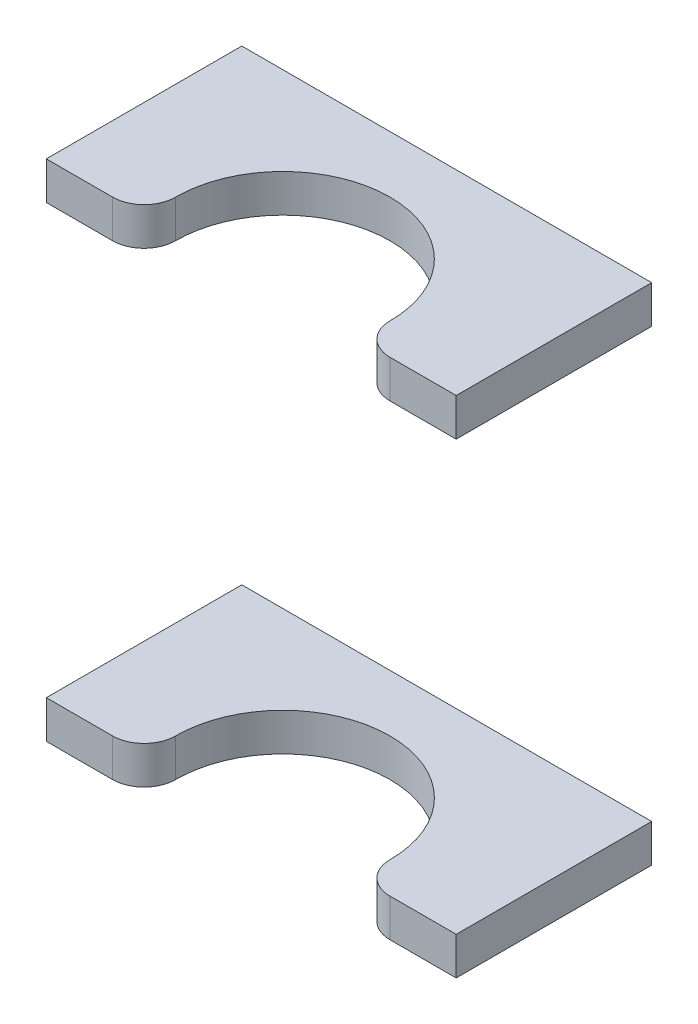
ISO-10303-21;
HEADER;
FILE_DESCRIPTION(('STEP AP214'),'2;1');
FILE_NAME('part.step','',(''),(''),'','','');
FILE_SCHEMA(('AUTOMOTIVE_DESIGN { 1 0 10303 214 1 1 1 1 }'));
ENDSEC;
DATA;
#1=APPLICATION_CONTEXT('core data for automotive mechanical design processes');
#2=APPLICATION_PROTOCOL_DEFINITION('international standard','automotive_design',2000,#1);
#3=PRODUCT_CONTEXT('',#1,'mechanical');
#4=PRODUCT('Part','Part','',(#3));
#5=PRODUCT_RELATED_PRODUCT_CATEGORY('part','',(#4));
#6=PRODUCT_DEFINITION_FORMATION('','',#4);
#7=PRODUCT_DEFINITION_CONTEXT('part definition',#1,'design');
#8=PRODUCT_DEFINITION('design','',#6,#7);
#9=PRODUCT_DEFINITION_SHAPE('','',#8);
#10=(LENGTH_UNIT() NAMED_UNIT(*) SI_UNIT(.MILLI.,.METRE.));
#11=(NAMED_UNIT(*) PLANE_ANGLE_UNIT() SI_UNIT($,.RADIAN.));
#12=(NAMED_UNIT(*) SI_UNIT($,.STERADIAN.) SOLID_ANGLE_UNIT());
#13=UNCERTAINTY_MEASURE_WITH_UNIT(LENGTH_MEASURE(1.E-05),#10,'distance_accuracy_value','');
#14=(GEOMETRIC_REPRESENTATION_CONTEXT(3) GLOBAL_UNCERTAINTY_ASSIGNED_CONTEXT((#13)) GLOBAL_UNIT_ASSIGNED_CONTEXT((#10,
#11,#12)) REPRESENTATION_CONTEXT('',''));
#15=CARTESIAN_POINT('',(0.,0.,0.));
#16=DIRECTION('',(0.,0.,1.));
#17=DIRECTION('',(1.,0.,0.));
#18=AXIS2_PLACEMENT_3D('',#15,#16,#17);
#19=CARTESIAN_POINT('',(-315.,100.,111.27633568147));
#20=DIRECTION('',(0.,-1.,0.));
#21=DIRECTION('',(0.,0.,-1.));
#22=AXIS2_PLACEMENT_3D('',#19,#20,#21);
#23=PLANE('',#22);
#24=DIRECTION('',(-1.,0.,0.));
#25=VECTOR('',#24,1.);
#26=CARTESIAN_POINT('',(-369.5,100.,30.9999999999995));
#27=LINE('',#26,#25);
#28=CARTESIAN_POINT('',(-380.,100.,30.9999999999993));
#29=VERTEX_POINT('',#28);
#30=CARTESIAN_POINT('',(-369.5,100.,30.9999999999994));
#31=VERTEX_POINT('',#30);
#32=EDGE_CURVE('P0_E127',#29,#31,#27,.F.);
#33=ORIENTED_EDGE('',*,*,#32,.T.);
#34=CARTESIAN_POINT('',(-369.5,100.,25.9999999999994));
#35=DIRECTION('',(0.,-1.,0.));
#36=DIRECTION('',(1.,0.,0.));
#37=AXIS2_PLACEMENT_3D('',#34,#35,#36);
#38=CIRCLE('',#37,5.);
#39=CARTESIAN_POINT('',(-364.5,100.,25.9999999999994));
#40=VERTEX_POINT('',#39);
#41=EDGE_CURVE('P0_E124',#40,#31,#38,.T.);
#42=ORIENTED_EDGE('',*,*,#41,.F.);
#43=CARTESIAN_POINT('',(-347.5,100.,25.9999999999994));
#44=DIRECTION('',(0.,-1.,0.));
#45=DIRECTION('',(1.,0.,0.));
#46=AXIS2_PLACEMENT_3D('',#43,#44,#45);
#47=CIRCLE('',#46,17.);
#48=CARTESIAN_POINT('',(-330.5,100.,25.9999999999994));
#49=VERTEX_POINT('',#48);
#50=EDGE_CURVE('P0_E19',#40,#49,#47,.T.);
#51=ORIENTED_EDGE('',*,*,#50,.T.);
#52=CARTESIAN_POINT('',(-325.5,100.,25.9999999999994));
#53=DIRECTION('',(0.,-1.,0.));
#54=DIRECTION('',(1.,0.,0.));
#55=AXIS2_PLACEMENT_3D('',#52,#53,#54);
#56=CIRCLE('',#55,5.);
#57=CARTESIAN_POINT('',(-325.5,100.,30.9999999999995));
#58=VERTEX_POINT('',#57);
#59=EDGE_CURVE('P0_E158',#58,#49,#56,.T.);
#60=ORIENTED_EDGE('',*,*,#59,.F.);
#61=DIRECTION('',(-1.,0.,0.));
#62=VECTOR('',#61,1.);
#63=CARTESIAN_POINT('',(-325.5,100.,30.9999999999995));
#64=LINE('',#63,#62);
#65=CARTESIAN_POINT('',(-315.,100.,30.9999999999993));
#66=VERTEX_POINT('',#65);
#67=EDGE_CURVE('P0_E96',#58,#66,#64,.F.);
#68=ORIENTED_EDGE('',*,*,#67,.T.);
#69=DIRECTION('',(0.,0.,1.));
#70=VECTOR('',#69,1.);
#71=CARTESIAN_POINT('',(-315.,100.,111.27633568147));
#72=LINE('',#71,#70);
#73=CARTESIAN_POINT('',(-315.,100.,0.));
#74=VERTEX_POINT('',#73);
#75=EDGE_CURVE('P0_E92',#66,#74,#72,.F.);
#76=ORIENTED_EDGE('',*,*,#75,.T.);
#77=DIRECTION('',(-1.,0.,0.));
#78=VECTOR('',#77,1.);
#79=CARTESIAN_POINT('',(0.,100.,0.));
#80=LINE('',#79,#78);
#81=CARTESIAN_POINT('',(-380.,100.,0.));
#82=VERTEX_POINT('',#81);
#83=EDGE_CURVE('P0_E141',#82,#74,#80,.F.);
#84=ORIENTED_EDGE('',*,*,#83,.F.);
#85=DIRECTION('',(0.,0.,1.));
#86=VECTOR('',#85,1.);
#87=CARTESIAN_POINT('',(-380.,100.,111.27633568147));
#88=LINE('',#87,#86);
#89=EDGE_CURVE('P0_E71',#82,#29,#88,.T.);
#90=ORIENTED_EDGE('',*,*,#89,.T.);
#91=EDGE_LOOP('',(#33,#42,#51,#60,#68,#76,#84,#90));
#92=FACE_BOUND('',#91,.T.);
#93=ADVANCED_FACE('P0_F16',(#92),#23,.F.);
#94=CARTESIAN_POINT('',(-347.5,100.,25.9999999999994));
#95=DIRECTION('',(0.,-1.,0.));
#96=DIRECTION('',(1.,0.,0.));
#97=AXIS2_PLACEMENT_3D('',#94,#95,#96);
#98=CYLINDRICAL_SURFACE('',#97,17.);
#99=ORIENTED_EDGE('',*,*,#50,.F.);
#100=DIRECTION('',(0.,-1.,0.));
#101=VECTOR('',#100,1.);
#102=CARTESIAN_POINT('',(-364.5,100.,25.9999999999994));
#103=LINE('',#102,#101);
#104=CARTESIAN_POINT('',(-364.5,94.,25.9999999999994));
#105=VERTEX_POINT('',#104);
#106=EDGE_CURVE('P0_E125',#105,#40,#103,.F.);
#107=ORIENTED_EDGE('',*,*,#106,.F.);
#108=CARTESIAN_POINT('',(-347.5,94.,25.9999999999994));
#109=DIRECTION('',(0.,-1.,0.));
#110=DIRECTION('',(1.,0.,0.));
#111=AXIS2_PLACEMENT_3D('',#108,#109,#110);
#112=CIRCLE('',#111,17.);
#113=CARTESIAN_POINT('',(-330.5,94.,25.9999999999994));
#114=VERTEX_POINT('',#113);
#115=EDGE_CURVE('P0_E115',#105,#114,#112,.T.);
#116=ORIENTED_EDGE('',*,*,#115,.T.);
#117=DIRECTION('',(0.,-1.,0.));
#118=VECTOR('',#117,1.);
#119=CARTESIAN_POINT('',(-330.5,100.,25.9999999999994));
#120=LINE('',#119,#118);
#121=EDGE_CURVE('P0_E156',#49,#114,#120,.T.);
#122=ORIENTED_EDGE('',*,*,#121,.F.);
#123=EDGE_LOOP('',(#99,#107,#116,#122));
#124=FACE_BOUND('',#123,.T.);
#125=ADVANCED_FACE('P0_F181',(#124),#98,.F.);
#126=CARTESIAN_POINT('',(-325.5,100.,25.9999999999994));
#127=DIRECTION('',(0.,-1.,0.));
#128=DIRECTION('',(1.,0.,0.));
#129=AXIS2_PLACEMENT_3D('',#126,#127,#128);
#130=CYLINDRICAL_SURFACE('',#129,5.);
#131=ORIENTED_EDGE('',*,*,#121,.T.);
#132=CARTESIAN_POINT('',(-325.5,94.,25.9999999999994));
#133=DIRECTION('',(0.,-1.,0.));
#134=DIRECTION('',(1.,0.,0.));
#135=AXIS2_PLACEMENT_3D('',#132,#133,#134);
#136=CIRCLE('',#135,5.);
#137=CARTESIAN_POINT('',(-325.5,94.,30.9999999999995));
#138=VERTEX_POINT('',#137);
#139=EDGE_CURVE('P0_E113',#114,#138,#136,.F.);
#140=ORIENTED_EDGE('',*,*,#139,.T.);
#141=DIRECTION('',(0.,1.,0.));
#142=VECTOR('',#141,1.);
#143=CARTESIAN_POINT('',(-325.5,100.,30.9999999999995));
#144=LINE('',#143,#142);
#145=EDGE_CURVE('P0_E112',#138,#58,#144,.T.);
#146=ORIENTED_EDGE('',*,*,#145,.T.);
#147=ORIENTED_EDGE('',*,*,#59,.T.);
#148=EDGE_LOOP('',(#131,#140,#146,#147));
#149=FACE_BOUND('',#148,.T.);
#150=ADVANCED_FACE('P0_F182',(#149),#130,.T.);
#151=CARTESIAN_POINT('',(-325.5,100.,30.9999999999995));
#152=DIRECTION('',(0.,0.,-1.));
#153=DIRECTION('',(-1.,0.,0.));
#154=AXIS2_PLACEMENT_3D('',#151,#152,#153);
#155=PLANE('',#154);
#156=ORIENTED_EDGE('',*,*,#67,.F.);
#157=ORIENTED_EDGE('',*,*,#145,.F.);
#158=DIRECTION('',(-1.,0.,0.));
#159=VECTOR('',#158,1.);
#160=CARTESIAN_POINT('',(-315.,94.,30.9999999999995));
#161=LINE('',#160,#159);
#162=CARTESIAN_POINT('',(-315.,94.,30.9999999999994));
#163=VERTEX_POINT('',#162);
#164=EDGE_CURVE('P0_E104',#138,#163,#161,.F.);
#165=ORIENTED_EDGE('',*,*,#164,.T.);
#166=DIRECTION('',(0.,1.,0.));
#167=VECTOR('',#166,1.);
#168=CARTESIAN_POINT('',(-315.,100.,30.9999999999993));
#169=LINE('',#168,#167);
#170=EDGE_CURVE('P0_E87',#163,#66,#169,.T.);
#171=ORIENTED_EDGE('',*,*,#170,.T.);
#172=EDGE_LOOP('',(#156,#157,#165,#171));
#173=FACE_BOUND('',#172,.T.);
#174=ADVANCED_FACE('P0_F110',(#173),#155,.F.);
#175=CARTESIAN_POINT('',(-315.,100.,111.27633568147));
#176=DIRECTION('',(-1.,0.,0.));
#177=DIRECTION('',(0.,0.,1.));
#178=AXIS2_PLACEMENT_3D('',#175,#176,#177);
#179=PLANE('',#178);
#180=ORIENTED_EDGE('',*,*,#170,.F.);
#181=DIRECTION('',(0.,0.,1.));
#182=VECTOR('',#181,1.);
#183=CARTESIAN_POINT('',(-315.,94.,111.27633568147));
#184=LINE('',#183,#182);
#185=CARTESIAN_POINT('',(-315.,94.,0.));
#186=VERTEX_POINT('',#185);
#187=EDGE_CURVE('P0_E91',#163,#186,#184,.F.);
#188=ORIENTED_EDGE('',*,*,#187,.T.);
#189=DIRECTION('',(0.,1.,0.));
#190=VECTOR('',#189,1.);
#191=CARTESIAN_POINT('',(-315.,0.,0.));
#192=LINE('',#191,#190);
#193=EDGE_CURVE('P0_E147',#74,#186,#192,.F.);
#194=ORIENTED_EDGE('',*,*,#193,.F.);
#195=ORIENTED_EDGE('',*,*,#75,.F.);
#196=EDGE_LOOP('',(#180,#188,#194,#195));
#197=FACE_BOUND('',#196,.T.);
#198=ADVANCED_FACE('P0_F89',(#197),#179,.F.);
#199=CARTESIAN_POINT('',(0.,0.,0.));
#200=DIRECTION('',(0.,0.,-1.));
#201=DIRECTION('',(-1.,0.,0.));
#202=AXIS2_PLACEMENT_3D('',#199,#200,#201);
#203=PLANE('',#202);
#204=DIRECTION('',(0.,1.,0.));
#205=VECTOR('',#204,1.);
#206=CARTESIAN_POINT('',(-380.,100.,0.));
#207=LINE('',#206,#205);
#208=CARTESIAN_POINT('',(-380.,94.,0.));
#209=VERTEX_POINT('',#208);
#210=EDGE_CURVE('P0_E138',#209,#82,#207,.T.);
#211=ORIENTED_EDGE('',*,*,#210,.T.);
#212=ORIENTED_EDGE('',*,*,#83,.T.);
#213=ORIENTED_EDGE('',*,*,#193,.T.);
#214=DIRECTION('',(-1.,0.,0.));
#215=VECTOR('',#214,1.);
#216=CARTESIAN_POINT('',(-315.,94.,0.));
#217=LINE('',#216,#215);
#218=EDGE_CURVE('P0_E108',#186,#209,#217,.T.);
#219=ORIENTED_EDGE('',*,*,#218,.T.);
#220=EDGE_LOOP('',(#211,#212,#213,#219));
#221=FACE_BOUND('',#220,.T.);
#222=ADVANCED_FACE('P0_F200',(#221),#203,.T.);
#223=CARTESIAN_POINT('',(-380.,100.,111.27633568147));
#224=DIRECTION('',(1.,0.,0.));
#225=DIRECTION('',(0.,1.,0.));
#226=AXIS2_PLACEMENT_3D('',#223,#224,#225);
#227=PLANE('',#226);
#228=DIRECTION('',(0.,1.,0.));
#229=VECTOR('',#228,1.);
#230=CARTESIAN_POINT('',(-380.,100.,30.9999999999994));
#231=LINE('',#230,#229);
#232=CARTESIAN_POINT('',(-380.,94.,30.9999999999993));
#233=VERTEX_POINT('',#232);
#234=EDGE_CURVE('P0_E128',#233,#29,#231,.T.);
#235=ORIENTED_EDGE('',*,*,#234,.T.);
#236=ORIENTED_EDGE('',*,*,#89,.F.);
#237=ORIENTED_EDGE('',*,*,#210,.F.);
#238=DIRECTION('',(0.,0.,1.));
#239=VECTOR('',#238,1.);
#240=CARTESIAN_POINT('',(-380.,94.,111.27633568147));
#241=LINE('',#240,#239);
#242=EDGE_CURVE('P0_E133',#209,#233,#241,.T.);
#243=ORIENTED_EDGE('',*,*,#242,.T.);
#244=EDGE_LOOP('',(#235,#236,#237,#243));
#245=FACE_BOUND('',#244,.T.);
#246=ADVANCED_FACE('P0_F194',(#245),#227,.F.);
#247=CARTESIAN_POINT('',(-369.5,100.,30.9999999999995));
#248=DIRECTION('',(0.,0.,-1.));
#249=DIRECTION('',(-1.,0.,0.));
#250=AXIS2_PLACEMENT_3D('',#247,#248,#249);
#251=PLANE('',#250);
#252=ORIENTED_EDGE('',*,*,#32,.F.);
#253=ORIENTED_EDGE('',*,*,#234,.F.);
#254=DIRECTION('',(-1.,0.,0.));
#255=VECTOR('',#254,1.);
#256=CARTESIAN_POINT('',(-315.,94.,30.9999999999993));
#257=LINE('',#256,#255);
#258=CARTESIAN_POINT('',(-369.5,94.,30.9999999999993));
#259=VERTEX_POINT('',#258);
#260=EDGE_CURVE('P0_E25',#233,#259,#257,.F.);
#261=ORIENTED_EDGE('',*,*,#260,.T.);
#262=DIRECTION('',(0.,-1.,0.));
#263=VECTOR('',#262,1.);
#264=CARTESIAN_POINT('',(-369.5,100.,30.9999999999994));
#265=LINE('',#264,#263);
#266=EDGE_CURVE('P0_E33',#31,#259,#265,.T.);
#267=ORIENTED_EDGE('',*,*,#266,.F.);
#268=EDGE_LOOP('',(#252,#253,#261,#267));
#269=FACE_BOUND('',#268,.T.);
#270=ADVANCED_FACE('P0_F186',(#269),#251,.F.);
#271=CARTESIAN_POINT('',(-369.5,100.,25.9999999999994));
#272=DIRECTION('',(0.,-1.,0.));
#273=DIRECTION('',(1.,0.,0.));
#274=AXIS2_PLACEMENT_3D('',#271,#272,#273);
#275=CYLINDRICAL_SURFACE('',#274,5.);
#276=ORIENTED_EDGE('',*,*,#266,.T.);
#277=CARTESIAN_POINT('',(-369.5,94.,25.9999999999994));
#278=DIRECTION('',(0.,-1.,0.));
#279=DIRECTION('',(1.,0.,0.));
#280=AXIS2_PLACEMENT_3D('',#277,#278,#279);
#281=CIRCLE('',#280,5.);
#282=EDGE_CURVE('P0_E11',#259,#105,#281,.F.);
#283=ORIENTED_EDGE('',*,*,#282,.T.);
#284=ORIENTED_EDGE('',*,*,#106,.T.);
#285=ORIENTED_EDGE('',*,*,#41,.T.);
#286=EDGE_LOOP('',(#276,#283,#284,#285));
#287=FACE_BOUND('',#286,.T.);
#288=ADVANCED_FACE('P0_F184',(#287),#275,.T.);
#289=CARTESIAN_POINT('',(-315.,94.,111.27633568147));
#290=DIRECTION('',(0.,1.,0.));
#291=DIRECTION('',(-1.,0.,0.));
#292=AXIS2_PLACEMENT_3D('',#289,#290,#291);
#293=PLANE('',#292);
#294=ORIENTED_EDGE('',*,*,#260,.F.);
#295=ORIENTED_EDGE('',*,*,#242,.F.);
#296=ORIENTED_EDGE('',*,*,#218,.F.);
#297=ORIENTED_EDGE('',*,*,#187,.F.);
#298=ORIENTED_EDGE('',*,*,#164,.F.);
#299=ORIENTED_EDGE('',*,*,#139,.F.);
#300=ORIENTED_EDGE('',*,*,#115,.F.);
#301=ORIENTED_EDGE('',*,*,#282,.F.);
#302=EDGE_LOOP('',(#294,#295,#296,#297,#298,#299,#300,#301));
#303=FACE_BOUND('',#302,.T.);
#304=ADVANCED_FACE('P0_F102',(#303),#293,.F.);
#305=CLOSED_SHELL('',(#93,#125,#150,#174,#198,#222,#246,#270,#288,#304));
#306=MANIFOLD_SOLID_BREP('P0_B1',#305);
#307=CARTESIAN_POINT('',(-315.,20.,111.27633568147));
#308=DIRECTION('',(0.,1.,0.));
#309=DIRECTION('',(0.,0.,1.));
#310=AXIS2_PLACEMENT_3D('',#307,#308,#309);
#311=PLANE('',#310);
#312=DIRECTION('',(-1.,0.,0.));
#313=VECTOR('',#312,1.);
#314=CARTESIAN_POINT('',(-369.5,20.,30.9999999999995));
#315=LINE('',#314,#313);
#316=CARTESIAN_POINT('',(-369.5,20.,30.9999999999995));
#317=VERTEX_POINT('',#316);
#318=CARTESIAN_POINT('',(-380.,20.,30.9999999999994));
#319=VERTEX_POINT('',#318);
#320=EDGE_CURVE('P1_E128',#317,#319,#315,.T.);
#321=ORIENTED_EDGE('',*,*,#320,.T.);
#322=DIRECTION('',(0.,0.,1.));
#323=VECTOR('',#322,1.);
#324=CARTESIAN_POINT('',(-380.,20.,111.27633568147));
#325=LINE('',#324,#323);
#326=CARTESIAN_POINT('',(-380.,20.,0.));
#327=VERTEX_POINT('',#326);
#328=EDGE_CURVE('P1_E122',#319,#327,#325,.F.);
#329=ORIENTED_EDGE('',*,*,#328,.T.);
#330=DIRECTION('',(1.,0.,0.));
#331=VECTOR('',#330,1.);
#332=CARTESIAN_POINT('',(0.,20.,0.));
#333=LINE('',#332,#331);
#334=CARTESIAN_POINT('',(-315.,20.,0.));
#335=VERTEX_POINT('',#334);
#336=EDGE_CURVE('P1_E117',#327,#335,#333,.T.);
#337=ORIENTED_EDGE('',*,*,#336,.T.);
#338=DIRECTION('',(0.,0.,1.));
#339=VECTOR('',#338,1.);
#340=CARTESIAN_POINT('',(-315.,20.,111.27633568147));
#341=LINE('',#340,#339);
#342=CARTESIAN_POINT('',(-315.,20.,30.9999999999994));
#343=VERTEX_POINT('',#342);
#344=EDGE_CURVE('P1_E91',#335,#343,#341,.T.);
#345=ORIENTED_EDGE('',*,*,#344,.T.);
#346=DIRECTION('',(-1.,0.,0.));
#347=VECTOR('',#346,1.);
#348=CARTESIAN_POINT('',(-325.5,20.,30.9999999999995));
#349=LINE('',#348,#347);
#350=CARTESIAN_POINT('',(-325.5,20.,30.9999999999995));
#351=VERTEX_POINT('',#350);
#352=EDGE_CURVE('P1_E88',#343,#351,#349,.T.);
#353=ORIENTED_EDGE('',*,*,#352,.T.);
#354=CARTESIAN_POINT('',(-325.5,20.,25.9999999999996));
#355=DIRECTION('',(0.,-1.,0.));
#356=DIRECTION('',(1.,0.,0.));
#357=AXIS2_PLACEMENT_3D('',#354,#355,#356);
#358=CIRCLE('',#357,5.);
#359=CARTESIAN_POINT('',(-330.5,20.,25.9999999999994));
#360=VERTEX_POINT('',#359);
#361=EDGE_CURVE('P1_E19',#360,#351,#358,.F.);
#362=ORIENTED_EDGE('',*,*,#361,.F.);
#363=CARTESIAN_POINT('',(-347.5,20.,25.9999999999994));
#364=DIRECTION('',(0.,-1.,0.));
#365=DIRECTION('',(1.,0.,0.));
#366=AXIS2_PLACEMENT_3D('',#363,#364,#365);
#367=CIRCLE('',#366,17.);
#368=CARTESIAN_POINT('',(-364.5,20.,25.9999999999996));
#369=VERTEX_POINT('',#368);
#370=EDGE_CURVE('P1_E101',#360,#369,#367,.F.);
#371=ORIENTED_EDGE('',*,*,#370,.T.);
#372=CARTESIAN_POINT('',(-369.5,20.,25.9999999999996));
#373=DIRECTION('',(0.,-1.,0.));
#374=DIRECTION('',(1.,0.,0.));
#375=AXIS2_PLACEMENT_3D('',#372,#373,#374);
#376=CIRCLE('',#375,5.);
#377=EDGE_CURVE('P1_E155',#317,#369,#376,.F.);
#378=ORIENTED_EDGE('',*,*,#377,.F.);
#379=EDGE_LOOP('',(#321,#329,#337,#345,#353,#362,#371,#378));
#380=FACE_BOUND('',#379,.T.);
#381=ADVANCED_FACE('P1_F16',(#380),#311,.F.);
#382=CARTESIAN_POINT('',(0.,0.,0.));
#383=DIRECTION('',(0.,0.,1.));
#384=DIRECTION('',(1.,0.,0.));
#385=AXIS2_PLACEMENT_3D('',#382,#383,#384);
#386=PLANE('',#385);
#387=DIRECTION('',(1.,0.,0.));
#388=VECTOR('',#387,1.);
#389=CARTESIAN_POINT('',(-315.,26.,0.));
#390=LINE('',#389,#388);
#391=CARTESIAN_POINT('',(-380.,26.,0.));
#392=VERTEX_POINT('',#391);
#393=CARTESIAN_POINT('',(-315.,26.,0.));
#394=VERTEX_POINT('',#393);
#395=EDGE_CURVE('P1_E111',#392,#394,#390,.T.);
#396=ORIENTED_EDGE('',*,*,#395,.T.);
#397=DIRECTION('',(0.,1.,0.));
#398=VECTOR('',#397,1.);
#399=CARTESIAN_POINT('',(-315.,20.,0.));
#400=LINE('',#399,#398);
#401=EDGE_CURVE('P1_E114',#394,#335,#400,.F.);
#402=ORIENTED_EDGE('',*,*,#401,.T.);
#403=ORIENTED_EDGE('',*,*,#336,.F.);
#404=DIRECTION('',(0.,1.,0.));
#405=VECTOR('',#404,1.);
#406=CARTESIAN_POINT('',(-380.,20.,0.));
#407=LINE('',#406,#405);
#408=EDGE_CURVE('P1_E125',#327,#392,#407,.T.);
#409=ORIENTED_EDGE('',*,*,#408,.T.);
#410=EDGE_LOOP('',(#396,#402,#403,#409));
#411=FACE_BOUND('',#410,.T.);
#412=ADVANCED_FACE('P1_F247',(#411),#386,.F.);
#413=CARTESIAN_POINT('',(-315.,20.,111.27633568147));
#414=DIRECTION('',(-1.,0.,0.));
#415=DIRECTION('',(0.,0.,1.));
#416=AXIS2_PLACEMENT_3D('',#413,#414,#415);
#417=PLANE('',#416);
#418=DIRECTION('',(0.,1.,0.));
#419=VECTOR('',#418,1.);
#420=CARTESIAN_POINT('',(-315.,100.,30.9999999999994));
#421=LINE('',#420,#419);
#422=CARTESIAN_POINT('',(-315.,26.,30.9999999999994));
#423=VERTEX_POINT('',#422);
#424=EDGE_CURVE('P1_E94',#423,#343,#421,.F.);
#425=ORIENTED_EDGE('',*,*,#424,.T.);
#426=ORIENTED_EDGE('',*,*,#344,.F.);
#427=ORIENTED_EDGE('',*,*,#401,.F.);
#428=DIRECTION('',(0.,0.,1.));
#429=VECTOR('',#428,1.);
#430=CARTESIAN_POINT('',(-315.,26.,111.27633568147));
#431=LINE('',#430,#429);
#432=EDGE_CURVE('P1_E108',#394,#423,#431,.T.);
#433=ORIENTED_EDGE('',*,*,#432,.T.);
#434=EDGE_LOOP('',(#425,#426,#427,#433));
#435=FACE_BOUND('',#434,.T.);
#436=ADVANCED_FACE('P1_F238',(#435),#417,.F.);
#437=CARTESIAN_POINT('',(-325.5,100.,30.9999999999995));
#438=DIRECTION('',(0.,0.,-1.));
#439=DIRECTION('',(-1.,0.,0.));
#440=AXIS2_PLACEMENT_3D('',#437,#438,#439);
#441=PLANE('',#440);
#442=ORIENTED_EDGE('',*,*,#352,.F.);
#443=ORIENTED_EDGE('',*,*,#424,.F.);
#444=DIRECTION('',(1.,0.,0.));
#445=VECTOR('',#444,1.);
#446=CARTESIAN_POINT('',(-315.,26.,30.9999999999995));
#447=LINE('',#446,#445);
#448=CARTESIAN_POINT('',(-325.5,26.,30.9999999999995));
#449=VERTEX_POINT('',#448);
#450=EDGE_CURVE('P1_E99',#423,#449,#447,.F.);
#451=ORIENTED_EDGE('',*,*,#450,.T.);
#452=DIRECTION('',(0.,-1.,0.));
#453=VECTOR('',#452,1.);
#454=CARTESIAN_POINT('',(-325.5,100.,30.9999999999996));
#455=LINE('',#454,#453);
#456=EDGE_CURVE('P1_E85',#351,#449,#455,.F.);
#457=ORIENTED_EDGE('',*,*,#456,.F.);
#458=EDGE_LOOP('',(#442,#443,#451,#457));
#459=FACE_BOUND('',#458,.T.);
#460=ADVANCED_FACE('P1_F97',(#459),#441,.F.);
#461=CARTESIAN_POINT('',(-325.5,100.,25.9999999999996));
#462=DIRECTION('',(0.,-1.,0.));
#463=DIRECTION('',(1.,0.,0.));
#464=AXIS2_PLACEMENT_3D('',#461,#462,#463);
#465=CYLINDRICAL_SURFACE('',#464,5.);
#466=ORIENTED_EDGE('',*,*,#456,.T.);
#467=CARTESIAN_POINT('',(-325.5,26.,25.9999999999996));
#468=DIRECTION('',(0.,-1.,0.));
#469=DIRECTION('',(1.,0.,0.));
#470=AXIS2_PLACEMENT_3D('',#467,#468,#469);
#471=CIRCLE('',#470,5.);
#472=CARTESIAN_POINT('',(-330.5,26.,25.9999999999994));
#473=VERTEX_POINT('',#472);
#474=EDGE_CURVE('P1_E153',#449,#473,#471,.T.);
#475=ORIENTED_EDGE('',*,*,#474,.T.);
#476=DIRECTION('',(0.,-1.,0.));
#477=VECTOR('',#476,1.);
#478=CARTESIAN_POINT('',(-330.5,100.,25.9999999999994));
#479=LINE('',#478,#477);
#480=EDGE_CURVE('P1_E87',#473,#360,#479,.T.);
#481=ORIENTED_EDGE('',*,*,#480,.T.);
#482=ORIENTED_EDGE('',*,*,#361,.T.);
#483=EDGE_LOOP('',(#466,#475,#481,#482));
#484=FACE_BOUND('',#483,.T.);
#485=ADVANCED_FACE('P1_F82',(#484),#465,.T.);
#486=CARTESIAN_POINT('',(-347.5,100.,25.9999999999994));
#487=DIRECTION('',(0.,-1.,0.));
#488=DIRECTION('',(1.,0.,0.));
#489=AXIS2_PLACEMENT_3D('',#486,#487,#488);
#490=CYLINDRICAL_SURFACE('',#489,17.);
#491=ORIENTED_EDGE('',*,*,#370,.F.);
#492=ORIENTED_EDGE('',*,*,#480,.F.);
#493=CARTESIAN_POINT('',(-347.5,26.,25.9999999999994));
#494=DIRECTION('',(0.,-1.,0.));
#495=DIRECTION('',(1.,0.,0.));
#496=AXIS2_PLACEMENT_3D('',#493,#494,#495);
#497=CIRCLE('',#496,17.);
#498=CARTESIAN_POINT('',(-364.5,26.,25.9999999999996));
#499=VERTEX_POINT('',#498);
#500=EDGE_CURVE('P1_E150',#473,#499,#497,.F.);
#501=ORIENTED_EDGE('',*,*,#500,.T.);
#502=DIRECTION('',(0.,-1.,0.));
#503=VECTOR('',#502,1.);
#504=CARTESIAN_POINT('',(-364.5,100.,25.9999999999996));
#505=LINE('',#504,#503);
#506=EDGE_CURVE('P1_E156',#369,#499,#505,.F.);
#507=ORIENTED_EDGE('',*,*,#506,.F.);
#508=EDGE_LOOP('',(#491,#492,#501,#507));
#509=FACE_BOUND('',#508,.T.);
#510=ADVANCED_FACE('P1_F160',(#509),#490,.F.);
#511=CARTESIAN_POINT('',(-369.5,100.,25.9999999999996));
#512=DIRECTION('',(0.,-1.,0.));
#513=DIRECTION('',(1.,0.,0.));
#514=AXIS2_PLACEMENT_3D('',#511,#512,#513);
#515=CYLINDRICAL_SURFACE('',#514,5.);
#516=ORIENTED_EDGE('',*,*,#506,.T.);
#517=CARTESIAN_POINT('',(-369.5,26.,25.9999999999996));
#518=DIRECTION('',(0.,-1.,0.));
#519=DIRECTION('',(1.,0.,0.));
#520=AXIS2_PLACEMENT_3D('',#517,#518,#519);
#521=CIRCLE('',#520,5.);
#522=CARTESIAN_POINT('',(-369.5,26.,30.9999999999995));
#523=VERTEX_POINT('',#522);
#524=EDGE_CURVE('P1_E147',#499,#523,#521,.T.);
#525=ORIENTED_EDGE('',*,*,#524,.T.);
#526=DIRECTION('',(0.,1.,0.));
#527=VECTOR('',#526,1.);
#528=CARTESIAN_POINT('',(-369.5,100.,30.9999999999995));
#529=LINE('',#528,#527);
#530=EDGE_CURVE('P1_E132',#523,#317,#529,.F.);
#531=ORIENTED_EDGE('',*,*,#530,.T.);
#532=ORIENTED_EDGE('',*,*,#377,.T.);
#533=EDGE_LOOP('',(#516,#525,#531,#532));
#534=FACE_BOUND('',#533,.T.);
#535=ADVANCED_FACE('P1_F183',(#534),#515,.T.);
#536=CARTESIAN_POINT('',(-369.5,100.,30.9999999999995));
#537=DIRECTION('',(0.,0.,-1.));
#538=DIRECTION('',(-1.,0.,0.));
#539=AXIS2_PLACEMENT_3D('',#536,#537,#538);
#540=PLANE('',#539);
#541=ORIENTED_EDGE('',*,*,#320,.F.);
#542=ORIENTED_EDGE('',*,*,#530,.F.);
#543=DIRECTION('',(1.,0.,0.));
#544=VECTOR('',#543,1.);
#545=CARTESIAN_POINT('',(-315.,26.,30.9999999999995));
#546=LINE('',#545,#544);
#547=CARTESIAN_POINT('',(-380.,26.,30.9999999999995));
#548=VERTEX_POINT('',#547);
#549=EDGE_CURVE('P1_E25',#523,#548,#546,.F.);
#550=ORIENTED_EDGE('',*,*,#549,.T.);
#551=DIRECTION('',(0.,1.,0.));
#552=VECTOR('',#551,1.);
#553=CARTESIAN_POINT('',(-380.,20.,30.9999999999995));
#554=LINE('',#553,#552);
#555=EDGE_CURVE('P1_E33',#548,#319,#554,.F.);
#556=ORIENTED_EDGE('',*,*,#555,.T.);
#557=EDGE_LOOP('',(#541,#542,#550,#556));
#558=FACE_BOUND('',#557,.T.);
#559=ADVANCED_FACE('P1_F180',(#558),#540,.F.);
#560=CARTESIAN_POINT('',(-380.,20.,111.27633568147));
#561=DIRECTION('',(1.,0.,0.));
#562=DIRECTION('',(0.,1.,0.));
#563=AXIS2_PLACEMENT_3D('',#560,#561,#562);
#564=PLANE('',#563);
#565=ORIENTED_EDGE('',*,*,#555,.F.);
#566=DIRECTION('',(0.,0.,1.));
#567=VECTOR('',#566,1.);
#568=CARTESIAN_POINT('',(-380.,26.,111.27633568147));
#569=LINE('',#568,#567);
#570=EDGE_CURVE('P1_E11',#548,#392,#569,.F.);
#571=ORIENTED_EDGE('',*,*,#570,.T.);
#572=ORIENTED_EDGE('',*,*,#408,.F.);
#573=ORIENTED_EDGE('',*,*,#328,.F.);
#574=EDGE_LOOP('',(#565,#571,#572,#573));
#575=FACE_BOUND('',#574,.T.);
#576=ADVANCED_FACE('P1_F191',(#575),#564,.F.);
#577=CARTESIAN_POINT('',(-315.,26.,111.27633568147));
#578=DIRECTION('',(0.,-1.,0.));
#579=DIRECTION('',(1.,0.,0.));
#580=AXIS2_PLACEMENT_3D('',#577,#578,#579);
#581=PLANE('',#580);
#582=ORIENTED_EDGE('',*,*,#549,.F.);
#583=ORIENTED_EDGE('',*,*,#524,.F.);
#584=ORIENTED_EDGE('',*,*,#500,.F.);
#585=ORIENTED_EDGE('',*,*,#474,.F.);
#586=ORIENTED_EDGE('',*,*,#450,.F.);
#587=ORIENTED_EDGE('',*,*,#432,.F.);
#588=ORIENTED_EDGE('',*,*,#395,.F.);
#589=ORIENTED_EDGE('',*,*,#570,.F.);
#590=EDGE_LOOP('',(#582,#583,#584,#585,#586,#587,#588,#589));
#591=FACE_BOUND('',#590,.T.);
#592=ADVANCED_FACE('P1_F182',(#591),#581,.F.);
#593=CLOSED_SHELL('',(#381,#412,#436,#460,#485,#510,#535,#559,#576,#592));
#594=MANIFOLD_SOLID_BREP('P1_B1',#593);
#595=ADVANCED_BREP_SHAPE_REPRESENTATION('',(#18,#306,#594),#14);
#596=SHAPE_DEFINITION_REPRESENTATION(#9,#595);
ENDSEC;
END-ISO-10303-21;
